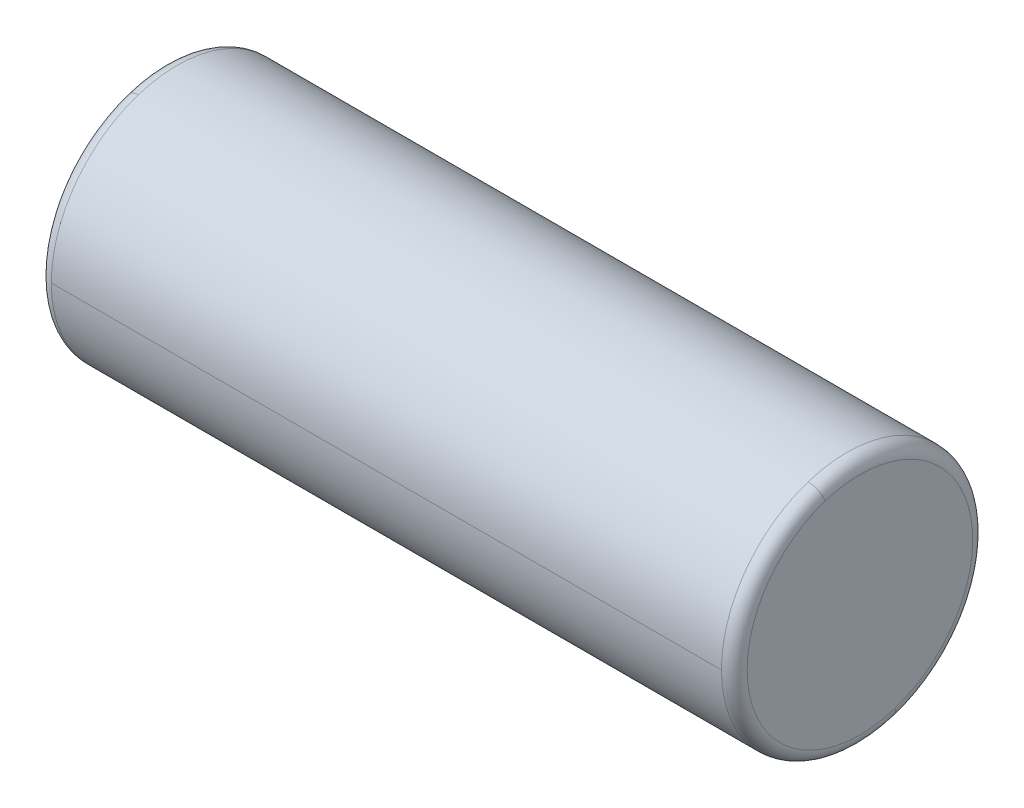
ISO-10303-21;
HEADER;
FILE_DESCRIPTION(('STEP AP214'),'2;1');
FILE_NAME('part.step','',(''),(''),'','','');
FILE_SCHEMA(('AUTOMOTIVE_DESIGN { 1 0 10303 214 1 1 1 1 }'));
ENDSEC;
DATA;
#1=APPLICATION_CONTEXT('core data for automotive mechanical design processes');
#2=APPLICATION_PROTOCOL_DEFINITION('international standard','automotive_design',2000,#1);
#3=PRODUCT_CONTEXT('',#1,'mechanical');
#4=PRODUCT('Part','Part','',(#3));
#5=PRODUCT_RELATED_PRODUCT_CATEGORY('part','',(#4));
#6=PRODUCT_DEFINITION_FORMATION('','',#4);
#7=PRODUCT_DEFINITION_CONTEXT('part definition',#1,'design');
#8=PRODUCT_DEFINITION('design','',#6,#7);
#9=PRODUCT_DEFINITION_SHAPE('','',#8);
#10=(LENGTH_UNIT() NAMED_UNIT(*) SI_UNIT(.MILLI.,.METRE.));
#11=(NAMED_UNIT(*) PLANE_ANGLE_UNIT() SI_UNIT($,.RADIAN.));
#12=(NAMED_UNIT(*) SI_UNIT($,.STERADIAN.) SOLID_ANGLE_UNIT());
#13=UNCERTAINTY_MEASURE_WITH_UNIT(LENGTH_MEASURE(1.E-05),#10,'distance_accuracy_value','');
#14=(GEOMETRIC_REPRESENTATION_CONTEXT(3) GLOBAL_UNCERTAINTY_ASSIGNED_CONTEXT((#13)) GLOBAL_UNIT_ASSIGNED_CONTEXT((#10,
#11,#12)) REPRESENTATION_CONTEXT('',''));
#15=CARTESIAN_POINT('',(0.,0.,0.));
#16=DIRECTION('',(0.,0.,1.));
#17=DIRECTION('',(1.,0.,0.));
#18=AXIS2_PLACEMENT_3D('',#15,#16,#17);
#19=CARTESIAN_POINT('',(4.,50.75,0.));
#20=DIRECTION('',(1.,0.,0.));
#21=DIRECTION('',(0.,0.,-1.));
#22=AXIS2_PLACEMENT_3D('',#19,#20,#21);
#23=PLANE('',#22);
#24=CARTESIAN_POINT('',(4.,53.5239148391939,0.901299566926841));
#25=CARTESIAN_POINT('',(4.,53.5091683074182,0.946688001011676));
#26=CARTESIAN_POINT('',(4.,53.4933059199763,0.991713781039006));
#27=CARTESIAN_POINT('',(4.,53.4593918073549,1.08093314309655));
#28=CARTESIAN_POINT('',(4.,53.4413400821754,1.12512672512677));
#29=CARTESIAN_POINT('',(4.,53.403089667674,1.21257480130799));
#30=CARTESIAN_POINT('',(4.,53.3828909783521,1.25582929545899));
#31=CARTESIAN_POINT('',(4.,53.3403955946315,1.34129510553932));
#32=CARTESIAN_POINT('',(4.,53.3180989002329,1.38350642146864));
#33=CARTESIAN_POINT('',(4.,53.2714611410246,1.46678415392998));
#34=CARTESIAN_POINT('',(4.,53.247120076215,1.50785057046199));
#35=CARTESIAN_POINT('',(4.,53.1964522373842,1.58873957968484));
#36=CARTESIAN_POINT('',(4.,53.1701254633631,1.62856217237568));
#37=CARTESIAN_POINT('',(4.,53.1155496238686,1.7068675956184));
#38=CARTESIAN_POINT('',(4.,53.0873005583951,1.74535042617028));
#39=CARTESIAN_POINT('',(4.,53.0289481920083,1.82088361721079));
#40=CARTESIAN_POINT('',(4.,52.998844891095,1.85793397769941));
#41=CARTESIAN_POINT('',(4.,52.9368565749047,1.93051297089295));
#42=CARTESIAN_POINT('',(4.,52.9049715596277,1.96604160359786));
#43=CARTESIAN_POINT('',(4.,52.8394966286152,2.03549154967787));
#44=CARTESIAN_POINT('',(4.,52.8059067128797,2.06941286305296));
#45=CARTESIAN_POINT('',(4.,52.7371029019695,2.13556645104698));
#46=CARTESIAN_POINT('',(4.,52.7018890067949,2.16779872566592));
#47=CARTESIAN_POINT('',(4.,52.6299220703725,2.23049658577788));
#48=CARTESIAN_POINT('',(4.,52.5931690291246,2.26096217127091));
#49=CARTESIAN_POINT('',(4.,52.5182123418491,2.32005325886632));
#50=CARTESIAN_POINT('',(4.,52.4800086958214,2.3486787609687));
#51=CARTESIAN_POINT('',(4.,52.4022428349163,2.40402072044118));
#52=CARTESIAN_POINT('',(4.,52.3626806200389,2.43073717781128));
#53=CARTESIAN_POINT('',(4.,52.282292930275,2.48219668553324));
#54=CARTESIAN_POINT('',(4.,52.2414674553886,2.5069397358851));
#55=CARTESIAN_POINT('',(4.,52.1586515977516,2.55439282139507));
#56=CARTESIAN_POINT('',(4.,52.1166612150011,2.57710285655318));
#57=CARTESIAN_POINT('',(4.,52.031616700146,2.62043520121178));
#58=CARTESIAN_POINT('',(4.,51.9885625680414,2.64105751071228));
#59=CARTESIAN_POINT('',(4.,51.9014942756533,2.68016472310576));
#60=CARTESIAN_POINT('',(4.,51.8574801153699,2.69864962599875));
#61=CARTESIAN_POINT('',(4.,51.7685978005916,2.73343749342707));
#62=CARTESIAN_POINT('',(4.,51.7237296460967,2.7497404579624));
#63=CARTESIAN_POINT('',(4.,51.6332474342097,2.78012517340586));
#64=CARTESIAN_POINT('',(4.,51.5876333768175,2.794206924314));
#65=CARTESIAN_POINT('',(4.,51.4957692473953,2.82011528833172));
#66=CARTESIAN_POINT('',(4.,51.4495191753654,2.83194190144131));
#67=CARTESIAN_POINT('',(4.,51.3564944371424,2.85331149851506));
#68=CARTESIAN_POINT('',(4.,51.3097197709493,2.86285448247923));
#69=CARTESIAN_POINT('',(4.,51.2157585286677,2.87963383137791));
#70=CARTESIAN_POINT('',(4.,51.1685719525793,2.88687019631242));
#71=CARTESIAN_POINT('',(4.,51.0739005671019,2.89901887411483));
#72=CARTESIAN_POINT('',(4.,51.0264157577129,2.90393118698273));
#73=CARTESIAN_POINT('',(4.,50.9312623006995,2.91141992645995));
#74=CARTESIAN_POINT('',(4.,50.8835936530751,2.91399635306926));
#75=CARTESIAN_POINT('',(4.,50.7881873575381,2.91680711319195));
#76=CARTESIAN_POINT('',(4.,50.7404497096255,2.91704144670532));
#77=CARTESIAN_POINT('',(4.,50.6450204176875,2.91516745610615));
#78=CARTESIAN_POINT('',(4.,50.597328773662,2.91305913199361));
#79=CARTESIAN_POINT('',(4.,50.5021063828459,2.90650490528008));
#80=CARTESIAN_POINT('',(4.,50.4545756360552,2.90205900267908));
#81=CARTESIAN_POINT('',(4.,50.3597895454409,2.89084032955742));
#82=CARTESIAN_POINT('',(4.,50.3125342016172,2.88406755903675));
#83=CARTESIAN_POINT('',(4.,50.2184127591993,2.86821146627315));
#84=CARTESIAN_POINT('',(4.,50.171546660605,2.85912814403022));
#85=CARTESIAN_POINT('',(4.,50.0783166131823,2.83867283034098));
#86=CARTESIAN_POINT('',(4.,50.0319526643539,2.82730083889467));
#87=CARTESIAN_POINT('',(4.,49.9398386112768,2.80229558292214));
#88=CARTESIAN_POINT('',(4.,49.894088507028,2.78866231839592));
#89=CARTESIAN_POINT('',(4.,49.8033123591184,2.75916735999194));
#90=CARTESIAN_POINT('',(4.,49.7582863154576,2.74330566611418));
#91=CARTESIAN_POINT('',(4.,49.6690667604069,2.709392061217));
#92=CARTESIAN_POINT('',(4.,49.6248732490171,2.69134015019757));
#93=CARTESIAN_POINT('',(4.,49.5374252245482,2.65308959965187));
#94=CARTESIAN_POINT('',(4.,49.4941707114692,2.63289096012558));
#95=CARTESIAN_POINT('',(4.,49.4087048875326,2.59039561285797));
#96=CARTESIAN_POINT('',(4.,49.366493576675,2.56809890511664));
#97=CARTESIAN_POINT('',(4.,49.2832158479264,2.52146113614085));
#98=CARTESIAN_POINT('',(4.,49.2421494300354,2.49712007490638));
#99=CARTESIAN_POINT('',(4.,49.1612604198178,2.44645223869284));
#100=CARTESIAN_POINT('',(4.,49.121437827491,2.42012546371378));
#101=CARTESIAN_POINT('',(4.,49.0431324045149,2.36554962351792));
#102=CARTESIAN_POINT('',(4.,49.0046495738654,2.33730055830113));
#103=CARTESIAN_POINT('',(4.,48.9291163827535,2.27894819210227));
#104=CARTESIAN_POINT('',(4.,48.892066022291,2.2488448911202));
#105=CARTESIAN_POINT('',(4.,48.8194870291166,2.18685657487956));
#106=CARTESIAN_POINT('',(4.,48.7839583964047,2.154971559621));
#107=CARTESIAN_POINT('',(4.,48.7145084503196,2.08949662862195));
#108=CARTESIAN_POINT('',(4.,48.6805871369464,2.05590671288146));
#109=CARTESIAN_POINT('',(4.,48.6144335489537,1.9871029019677));
#110=CARTESIAN_POINT('',(4.,48.5822012743343,1.95188900679443));
#111=CARTESIAN_POINT('',(4.,48.5195034142219,1.87992207037295));
#112=CARTESIAN_POINT('',(4.,48.4890378287291,1.84316902912474));
#113=CARTESIAN_POINT('',(4.,48.4299467411337,1.76821234184894));
#114=CARTESIAN_POINT('',(4.,48.4013212390313,1.73000869582136));
#115=CARTESIAN_POINT('',(4.,48.3459792795588,1.65224283491632));
#116=CARTESIAN_POINT('',(4.,48.3192628221887,1.61268062003887));
#117=CARTESIAN_POINT('',(4.,48.2678033144668,1.532292930275));
#118=CARTESIAN_POINT('',(4.,48.2430602641149,1.49146745538858));
#119=CARTESIAN_POINT('',(4.,48.1956071786049,1.40865159775164));
#120=CARTESIAN_POINT('',(4.,48.1728971434468,1.36666121500113));
#121=CARTESIAN_POINT('',(4.,48.1295647987882,1.28161670014598));
#122=CARTESIAN_POINT('',(4.,48.1089424892877,1.23856256804136));
#123=CARTESIAN_POINT('',(4.,48.0698352768942,1.15149427565331));
#124=CARTESIAN_POINT('',(4.,48.0513503740012,1.1074801153699));
#125=CARTESIAN_POINT('',(4.,48.0165625065729,1.01859780059161));
#126=CARTESIAN_POINT('',(4.,48.0002595420376,0.973729646096735));
#127=CARTESIAN_POINT('',(4.,47.9698748265941,0.883247434209639));
#128=CARTESIAN_POINT('',(4.,47.9557930756859,0.837633376817419));
#129=CARTESIAN_POINT('',(4.,47.9298847116684,0.745769247395375));
#130=CARTESIAN_POINT('',(4.,47.9180580985592,0.699519175365551));
#131=CARTESIAN_POINT('',(4.,47.8966885014844,0.606494437142247));
#132=CARTESIAN_POINT('',(4.,47.8871455175189,0.559719770948768));
#133=CARTESIAN_POINT('',(4.,47.870366168624,0.465758528668218));
#134=CARTESIAN_POINT('',(4.,47.8631298036945,0.418571952581148));
#135=CARTESIAN_POINT('',(4.,47.8509811258782,0.323900567099962));
#136=CARTESIAN_POINT('',(4.,47.8460688129913,0.276415757705846));
#137=CARTESIAN_POINT('',(4.,47.8385800735661,0.181262300706558));
#138=CARTESIAN_POINT('',(4.,47.8360036470277,0.133593653101386));
#139=CARTESIAN_POINT('',(4.,47.833192886711,0.0381873575117354));
#140=CARTESIAN_POINT('',(4.,47.8329585529327,-0.00955029047274379));
#141=CARTESIAN_POINT('',(4.,47.8348325442559,-0.104979582214222));
#142=CARTESIAN_POINT('',(4.,47.8369408693575,-0.152671225971221));
#143=CARTESIAN_POINT('',(4.,47.8434950933689,-0.247893617520897));
#144=CARTESIAN_POINT('',(4.,47.8479409922787,-0.295424365313575));
#145=CARTESIAN_POINT('',(4.,47.8591596754848,-0.390210453190387));
#146=CARTESIAN_POINT('',(4.,47.865932459781,-0.437465793274523));
#147=CARTESIAN_POINT('',(4.,47.8817885149091,-0.53158724590899));
#148=CARTESIAN_POINT('',(4.,47.8908717857408,-0.578453358459322));
#149=CARTESIAN_POINT('',(4.,47.911327239888,-0.671683367753326));
#150=CARTESIAN_POINT('',(4.,47.9226994232033,-0.718047264496998));
#151=CARTESIAN_POINT('',(4.,47.9477041549798,-0.810161459872296));
#152=CARTESIAN_POINT('',(4.,47.961336703441,-0.855911758503923));
#153=CARTESIAN_POINT('',(4.,47.9760851608061,-0.901299566926831));
#154=B_SPLINE_CURVE_WITH_KNOTS('',3,(#24,#25,#26,#27,#28,#29,#30,#31,#32,#33,#34,#35,#36,#37,
#38,#39,#40,#41,#42,#43,#44,#45,#46,#47,#48,#49,#50,#51,#52,#53,#54,#55,#56,#57,#58,#59,#60,#61,
#62,#63,#64,#65,#66,#67,#68,#69,#70,#71,#72,#73,#74,#75,#76,#77,#78,#79,#80,#81,#82,#83,#84,#85,
#86,#87,#88,#89,#90,#91,#92,#93,#94,#95,#96,#97,#98,#99,#100,#101,#102,#103,#104,#105,#106,#107,
#108,#109,#110,#111,#112,#113,#114,#115,#116,#117,#118,#119,#120,#121,#122,#123,#124,#125,#126,
#127,#128,#129,#130,#131,#132,#133,#134,#135,#136,#137,#138,#139,#140,#141,#142,#143,#144,#145,
#146,#147,#148,#149,#150,#151,#152,#153),.UNSPECIFIED.,.F.,.F.,(4,2,2,2,2,2,2,2,2,2,2,2,2,2,2,2,
2,2,2,2,2,2,2,2,2,2,2,2,2,2,2,2,2,2,2,2,2,2,2,2,2,2,2,2,2,2,2,2,2,2,2,2,2,2,2,2,2,2,2,2,2,2,2,2,
4),(0.,0.14315716638364,0.286314332767282,0.429471499150922,0.572628665534562,0.715785831918205,
0.858942998301844,1.00210016468549,1.14525733106912,1.28841449745277,1.43157166383641,
1.57472883022005,1.71788599660369,1.86104316298733,2.00420032937097,2.14735749575461,
2.29051466213825,2.43367182852189,2.57682899490553,2.71998616128918,2.86314332767281,
3.00630049405645,3.14945766044009,3.29261482682374,3.43577199320738,3.57892915959102,
3.72208632597466,3.8652434923583,4.00840065874194,4.15155782512558,4.29471499150922,
4.43787215789286,4.5810293242765,4.72418649066014,4.86734365704378,5.01050082342742,
5.15365798981106,5.29681515619471,5.43997232257835,5.58312948896199,5.72628665534563,
5.86944382172927,6.01260098811291,6.15575815449655,6.29891532088019,6.44207248726384,
6.58522965364747,6.72838682003111,6.87154398641476,7.0147011527984,7.15785831918204,
7.30101548556568,7.44417265194932,7.58732981833296,7.7304869847166,7.87364415110024,
8.01680131748388,8.15995848386752,8.30311565025116,8.4462728166348,8.58942998301844,
8.73258714940209,8.87574431578573,9.01890148216937,9.16205864855301),.UNSPECIFIED.);
#155=CARTESIAN_POINT('',(4.,53.5239148391939,0.901299566926841));
#156=VERTEX_POINT('',#155);
#157=CARTESIAN_POINT('',(4.,47.9760851608061,-0.901299566926841));
#158=VERTEX_POINT('',#157);
#159=EDGE_CURVE('E11',#156,#158,#154,.T.);
#160=ORIENTED_EDGE('',*,*,#159,.F.);
#161=CARTESIAN_POINT('',(4.,47.9760851608061,-0.901299566926841));
#162=CARTESIAN_POINT('',(4.,47.9908316925818,-0.946688001011676));
#163=CARTESIAN_POINT('',(4.,48.0066940800237,-0.991713781039005));
#164=CARTESIAN_POINT('',(4.,48.0406081926451,-1.08093314309655));
#165=CARTESIAN_POINT('',(4.,48.0586599178246,-1.12512672512677));
#166=CARTESIAN_POINT('',(4.,48.096910332326,-1.21257480130799));
#167=CARTESIAN_POINT('',(4.,48.1171090216479,-1.25582929545899));
#168=CARTESIAN_POINT('',(4.,48.1596044053685,-1.34129510553932));
#169=CARTESIAN_POINT('',(4.,48.1819010997671,-1.38350642146864));
#170=CARTESIAN_POINT('',(4.,48.2285388589754,-1.46678415392998));
#171=CARTESIAN_POINT('',(4.,48.252879923785,-1.50785057046199));
#172=CARTESIAN_POINT('',(4.,48.3035477626158,-1.58873957968484));
#173=CARTESIAN_POINT('',(4.,48.3298745366369,-1.62856217237568));
#174=CARTESIAN_POINT('',(4.,48.3844503761314,-1.7068675956184));
#175=CARTESIAN_POINT('',(4.,48.4126994416049,-1.74535042617028));
#176=CARTESIAN_POINT('',(4.,48.4710518079917,-1.82088361721079));
#177=CARTESIAN_POINT('',(4.,48.501155108905,-1.85793397769941));
#178=CARTESIAN_POINT('',(4.,48.5631434250953,-1.93051297089295));
#179=CARTESIAN_POINT('',(4.,48.5950284403723,-1.96604160359786));
#180=CARTESIAN_POINT('',(4.,48.6605033713848,-2.03549154967787));
#181=CARTESIAN_POINT('',(4.,48.6940932871204,-2.06941286305296));
#182=CARTESIAN_POINT('',(4.,48.7628970980305,-2.13556645104698));
#183=CARTESIAN_POINT('',(4.,48.7981109932051,-2.16779872566592));
#184=CARTESIAN_POINT('',(4.,48.8700779296275,-2.23049658577788));
#185=CARTESIAN_POINT('',(4.,48.9068309708754,-2.26096217127091));
#186=CARTESIAN_POINT('',(4.,48.9817876581509,-2.32005325886632));
#187=CARTESIAN_POINT('',(4.,49.0199913041786,-2.3486787609687));
#188=CARTESIAN_POINT('',(4.,49.0977571650837,-2.40402072044118));
#189=CARTESIAN_POINT('',(4.,49.1373193799611,-2.43073717781128));
#190=CARTESIAN_POINT('',(4.,49.217707069725,-2.48219668553324));
#191=CARTESIAN_POINT('',(4.,49.2585325446114,-2.5069397358851));
#192=CARTESIAN_POINT('',(4.,49.3413484022484,-2.55439282139507));
#193=CARTESIAN_POINT('',(4.,49.3833387849989,-2.57710285655318));
#194=CARTESIAN_POINT('',(4.,49.468383299854,-2.62043520121178));
#195=CARTESIAN_POINT('',(4.,49.5114374319587,-2.64105751071228));
#196=CARTESIAN_POINT('',(4.,49.5985057243467,-2.68016472310576));
#197=CARTESIAN_POINT('',(4.,49.6425198846301,-2.69864962599875));
#198=CARTESIAN_POINT('',(4.,49.7314021994084,-2.73343749342707));
#199=CARTESIAN_POINT('',(4.,49.7762703539033,-2.7497404579624));
#200=CARTESIAN_POINT('',(4.,49.8667525657904,-2.78012517340586));
#201=CARTESIAN_POINT('',(4.,49.9123666231825,-2.794206924314));
#202=CARTESIAN_POINT('',(4.,50.0042307526047,-2.82011528833172));
#203=CARTESIAN_POINT('',(4.,50.0504808246346,-2.83194190144131));
#204=CARTESIAN_POINT('',(4.,50.1435055628576,-2.85331149851506));
#205=CARTESIAN_POINT('',(4.,50.1902802290507,-2.86285448247923));
#206=CARTESIAN_POINT('',(4.,50.2842414713323,-2.87963383137791));
#207=CARTESIAN_POINT('',(4.,50.3314280474208,-2.88687019631242));
#208=CARTESIAN_POINT('',(4.,50.4260994328982,-2.89901887411483));
#209=CARTESIAN_POINT('',(4.,50.4735842422871,-2.90393118698273));
#210=CARTESIAN_POINT('',(4.,50.5687376993005,-2.91141992645995));
#211=CARTESIAN_POINT('',(4.,50.6164063469249,-2.91399635306926));
#212=CARTESIAN_POINT('',(4.,50.7118126424619,-2.91680711319195));
#213=CARTESIAN_POINT('',(4.,50.7595502903745,-2.91704144670532));
#214=CARTESIAN_POINT('',(4.,50.8549795823125,-2.91516745610615));
#215=CARTESIAN_POINT('',(4.,50.902671226338,-2.91305913199361));
#216=CARTESIAN_POINT('',(4.,50.9978936171541,-2.90650490528008));
#217=CARTESIAN_POINT('',(4.,51.0454243639448,-2.90205900267908));
#218=CARTESIAN_POINT('',(4.,51.1402104545591,-2.89084032955742));
#219=CARTESIAN_POINT('',(4.,51.1874657983828,-2.88406755903675));
#220=CARTESIAN_POINT('',(4.,51.2815872408007,-2.86821146627315));
#221=CARTESIAN_POINT('',(4.,51.328453339395,-2.85912814403022));
#222=CARTESIAN_POINT('',(4.,51.4216833868177,-2.83867283034098));
#223=CARTESIAN_POINT('',(4.,51.4680473356461,-2.82730083889467));
#224=CARTESIAN_POINT('',(4.,51.5601613887233,-2.80229558292214));
#225=CARTESIAN_POINT('',(4.,51.605911492972,-2.78866231839592));
#226=CARTESIAN_POINT('',(4.,51.6966876408816,-2.75916735999194));
#227=CARTESIAN_POINT('',(4.,51.7417136845425,-2.74330566611418));
#228=CARTESIAN_POINT('',(4.,51.8309332395931,-2.709392061217));
#229=CARTESIAN_POINT('',(4.,51.8751267509829,-2.69134015019757));
#230=CARTESIAN_POINT('',(4.,51.9625747754518,-2.65308959965187));
#231=CARTESIAN_POINT('',(4.,52.0058292885308,-2.63289096012558));
#232=CARTESIAN_POINT('',(4.,52.0912951124675,-2.59039561285797));
#233=CARTESIAN_POINT('',(4.,52.133506423325,-2.56809890511664));
#234=CARTESIAN_POINT('',(4.,52.2167841520736,-2.52146113614085));
#235=CARTESIAN_POINT('',(4.,52.2578505699646,-2.49712007490638));
#236=CARTESIAN_POINT('',(4.,52.3387395801823,-2.44645223869284));
#237=CARTESIAN_POINT('',(4.,52.378562172509,-2.42012546371378));
#238=CARTESIAN_POINT('',(4.,52.4568675954851,-2.36554962351792));
#239=CARTESIAN_POINT('',(4.,52.4953504261346,-2.33730055830114));
#240=CARTESIAN_POINT('',(4.,52.5708836172465,-2.27894819210227));
#241=CARTESIAN_POINT('',(4.,52.607933977709,-2.2488448911202));
#242=CARTESIAN_POINT('',(4.,52.6805129708834,-2.18685657487956));
#243=CARTESIAN_POINT('',(4.,52.7160416035953,-2.154971559621));
#244=CARTESIAN_POINT('',(4.,52.7854915496804,-2.08949662862195));
#245=CARTESIAN_POINT('',(4.,52.8194128630536,-2.05590671288146));
#246=CARTESIAN_POINT('',(4.,52.8855664510463,-1.9871029019677));
#247=CARTESIAN_POINT('',(4.,52.9177987256657,-1.95188900679443));
#248=CARTESIAN_POINT('',(4.,52.9804965857781,-1.87992207037295));
#249=CARTESIAN_POINT('',(4.,53.010962171271,-1.84316902912475));
#250=CARTESIAN_POINT('',(4.,53.0700532588663,-1.76821234184895));
#251=CARTESIAN_POINT('',(4.,53.0986787609687,-1.73000869582136));
#252=CARTESIAN_POINT('',(4.,53.1540207204412,-1.65224283491632));
#253=CARTESIAN_POINT('',(4.,53.1807371778113,-1.61268062003888));
#254=CARTESIAN_POINT('',(4.,53.2321966855332,-1.532292930275));
#255=CARTESIAN_POINT('',(4.,53.2569397358851,-1.49146745538858));
#256=CARTESIAN_POINT('',(4.,53.3043928213951,-1.40865159775164));
#257=CARTESIAN_POINT('',(4.,53.3271028565532,-1.36666121500113));
#258=CARTESIAN_POINT('',(4.,53.3704352012118,-1.28161670014599));
#259=CARTESIAN_POINT('',(4.,53.3910575107123,-1.23856256804136));
#260=CARTESIAN_POINT('',(4.,53.4301647231058,-1.15149427565332));
#261=CARTESIAN_POINT('',(4.,53.4486496259988,-1.1074801153699));
#262=CARTESIAN_POINT('',(4.,53.4834374934271,-1.01859780059162));
#263=CARTESIAN_POINT('',(4.,53.4997404579624,-0.973729646096739));
#264=CARTESIAN_POINT('',(4.,53.5301251734059,-0.883247434209643));
#265=CARTESIAN_POINT('',(4.,53.5442069243141,-0.837633376817423));
#266=CARTESIAN_POINT('',(4.,53.5701152883316,-0.745769247395379));
#267=CARTESIAN_POINT('',(4.,53.5819419014408,-0.699519175365554));
#268=CARTESIAN_POINT('',(4.,53.6033114985156,-0.606494437142251));
#269=CARTESIAN_POINT('',(4.,53.6128544824811,-0.559719770948772));
#270=CARTESIAN_POINT('',(4.,53.629633831376,-0.465758528668222));
#271=CARTESIAN_POINT('',(4.,53.6368701963055,-0.418571952581151));
#272=CARTESIAN_POINT('',(4.,53.6490188741218,-0.323900567099965));
#273=CARTESIAN_POINT('',(4.,53.6539311870087,-0.27641575770585));
#274=CARTESIAN_POINT('',(4.,53.661419926434,-0.181262300706564));
#275=CARTESIAN_POINT('',(4.,53.6639963529723,-0.133593653101392));
#276=CARTESIAN_POINT('',(4.,53.666807113289,-0.0381873575117411));
#277=CARTESIAN_POINT('',(4.,53.6670414470673,0.00955029047273823));
#278=CARTESIAN_POINT('',(4.,53.6651674557441,0.104979582214216));
#279=CARTESIAN_POINT('',(4.,53.6630591306426,0.152671225971215));
#280=CARTESIAN_POINT('',(4.,53.6565049066311,0.247893617520892));
#281=CARTESIAN_POINT('',(4.,53.6520590077213,0.295424365313569));
#282=CARTESIAN_POINT('',(4.,53.6408403245152,0.390210453190383));
#283=CARTESIAN_POINT('',(4.,53.634067540219,0.437465793274519));
#284=CARTESIAN_POINT('',(4.,53.6182114850909,0.531587245908987));
#285=CARTESIAN_POINT('',(4.,53.6091282142592,0.578453358459319));
#286=CARTESIAN_POINT('',(4.,53.588672760112,0.671683367753323));
#287=CARTESIAN_POINT('',(4.,53.5773005767967,0.718047264496995));
#288=CARTESIAN_POINT('',(4.,53.5522958450202,0.810161459872292));
#289=CARTESIAN_POINT('',(4.,53.538663296559,0.855911758503917));
#290=CARTESIAN_POINT('',(4.,53.5239148391939,0.901299566926825));
#291=B_SPLINE_CURVE_WITH_KNOTS('',3,(#161,#162,#163,#164,#165,#166,#167,#168,#169,#170,#171,
#172,#173,#174,#175,#176,#177,#178,#179,#180,#181,#182,#183,#184,#185,#186,#187,#188,#189,#190,
#191,#192,#193,#194,#195,#196,#197,#198,#199,#200,#201,#202,#203,#204,#205,#206,#207,#208,#209,
#210,#211,#212,#213,#214,#215,#216,#217,#218,#219,#220,#221,#222,#223,#224,#225,#226,#227,#228,
#229,#230,#231,#232,#233,#234,#235,#236,#237,#238,#239,#240,#241,#242,#243,#244,#245,#246,#247,
#248,#249,#250,#251,#252,#253,#254,#255,#256,#257,#258,#259,#260,#261,#262,#263,#264,#265,#266,
#267,#268,#269,#270,#271,#272,#273,#274,#275,#276,#277,#278,#279,#280,#281,#282,#283,#284,#285,
#286,#287,#288,#289,#290),.UNSPECIFIED.,.F.,.F.,(4,2,2,2,2,2,2,2,2,2,2,2,2,2,2,2,2,2,2,2,2,2,2,
2,2,2,2,2,2,2,2,2,2,2,2,2,2,2,2,2,2,2,2,2,2,2,2,2,2,2,2,2,2,2,2,2,2,2,2,2,2,2,2,2,4),(0.,
0.14315716638364,0.286314332767282,0.429471499150921,0.572628665534561,0.715785831918205,
0.858942998301843,1.00210016468549,1.14525733106912,1.28841449745277,1.43157166383641,
1.57472883022005,1.71788599660369,1.86104316298733,2.00420032937097,2.14735749575461,
2.29051466213825,2.43367182852189,2.57682899490553,2.71998616128917,2.86314332767281,
3.00630049405645,3.14945766044009,3.29261482682374,3.43577199320737,3.57892915959102,
3.72208632597466,3.8652434923583,4.00840065874193,4.15155782512558,4.29471499150922,
4.43787215789286,4.5810293242765,4.72418649066014,4.86734365704378,5.01050082342742,
5.15365798981106,5.29681515619471,5.43997232257834,5.58312948896199,5.72628665534563,
5.86944382172927,6.01260098811291,6.15575815449655,6.29891532088019,6.44207248726383,
6.58522965364747,6.72838682003111,6.87154398641475,7.01470115279839,7.15785831918203,
7.30101548556568,7.44417265194932,7.58732981833296,7.7304869847166,7.87364415110024,
8.01680131748388,8.15995848386752,8.30311565025116,8.4462728166348,8.58942998301844,
8.73258714940208,8.87574431578572,9.01890148216936,9.162058648553),.UNSPECIFIED.);
#292=EDGE_CURVE('E26',#158,#156,#291,.T.);
#293=ORIENTED_EDGE('',*,*,#292,.F.);
#294=EDGE_LOOP('',(#160,#293));
#295=FACE_BOUND('',#294,.T.);
#296=ADVANCED_FACE('F17',(#295),#23,.F.);
#297=CARTESIAN_POINT('',(4.33333333333361,50.75,0.));
#298=DIRECTION('',(1.,0.,0.));
#299=DIRECTION('',(0.,-0.309016994374947,0.951056516295154));
#300=AXIS2_PLACEMENT_3D('',#297,#298,#299);
#301=TOROIDAL_SURFACE('',#300,2.91666666666638,0.333333333333611);
#302=CARTESIAN_POINT('',(4.33333333333361,47.9760851608061,-0.901299566926841));
#303=DIRECTION('',(0.,0.309016994374949,-0.951056516295153));
#304=DIRECTION('',(-9.32587340684358E-13,-0.951056516295153,-0.309016994374949));
#305=AXIS2_PLACEMENT_3D('',#302,#303,#304);
#306=CIRCLE('',#305,0.33333333333361);
#307=CARTESIAN_POINT('',(4.3333333333333,47.6590663220408,-1.00430523171858));
#308=VERTEX_POINT('',#307);
#309=EDGE_CURVE('E139',#308,#158,#306,.T.);
#310=ORIENTED_EDGE('',*,*,#309,.T.);
#311=ORIENTED_EDGE('',*,*,#292,.T.);
#312=CARTESIAN_POINT('',(4.33333333333361,53.5239148391939,0.901299566926841));
#313=DIRECTION('',(0.,-0.309016994374949,0.951056516295153));
#314=DIRECTION('',(-9.32587340684358E-13,0.951056516295153,0.309016994374949));
#315=AXIS2_PLACEMENT_3D('',#312,#313,#314);
#316=CIRCLE('',#315,0.33333333333361);
#317=CARTESIAN_POINT('',(4.3333333333333,53.8409336779592,1.00430523171858));
#318=VERTEX_POINT('',#317);
#319=EDGE_CURVE('E135',#318,#156,#316,.T.);
#320=ORIENTED_EDGE('',*,*,#319,.F.);
#321=CARTESIAN_POINT('',(4.3333333333333,50.75,0.));
#322=DIRECTION('',(1.,0.,0.));
#323=DIRECTION('',(0.,0.,-1.));
#324=AXIS2_PLACEMENT_3D('',#321,#322,#323);
#325=CIRCLE('',#324,3.25);
#326=CARTESIAN_POINT('',(4.3333333333333,50.75,-3.25));
#327=VERTEX_POINT('',#326);
#328=EDGE_CURVE('E130',#327,#318,#325,.T.);
#329=ORIENTED_EDGE('',*,*,#328,.F.);
#330=CARTESIAN_POINT('',(4.3333333333333,50.75,0.));
#331=DIRECTION('',(1.,0.,0.));
#332=DIRECTION('',(0.,0.,-1.));
#333=AXIS2_PLACEMENT_3D('',#330,#331,#332);
#334=CIRCLE('',#333,3.25);
#335=EDGE_CURVE('E125',#308,#327,#334,.T.);
#336=ORIENTED_EDGE('',*,*,#335,.F.);
#337=EDGE_LOOP('',(#310,#311,#320,#329,#336));
#338=FACE_BOUND('',#337,.T.);
#339=ADVANCED_FACE('F146',(#338),#301,.T.);
#340=CARTESIAN_POINT('',(22.,50.75,0.));
#341=DIRECTION('',(1.,0.,0.));
#342=DIRECTION('',(0.,1.,0.));
#343=AXIS2_PLACEMENT_3D('',#340,#341,#342);
#344=CYLINDRICAL_SURFACE('',#343,3.25);
#345=DIRECTION('',(1.,0.,0.));
#346=VECTOR('',#345,1.);
#347=CARTESIAN_POINT('',(4.3333333333333,50.75,3.25));
#348=LINE('',#347,#346);
#349=CARTESIAN_POINT('',(4.3333333333333,50.75,3.25));
#350=VERTEX_POINT('',#349);
#351=CARTESIAN_POINT('',(21.666666666667,50.75,3.25));
#352=VERTEX_POINT('',#351);
#353=EDGE_CURVE('E92',#350,#352,#348,.T.);
#354=ORIENTED_EDGE('',*,*,#353,.F.);
#355=CARTESIAN_POINT('',(4.3333333333333,50.75,0.));
#356=DIRECTION('',(1.,0.,0.));
#357=DIRECTION('',(0.,0.,-1.));
#358=AXIS2_PLACEMENT_3D('',#355,#356,#357);
#359=CIRCLE('',#358,3.25);
#360=EDGE_CURVE('E117',#350,#308,#359,.T.);
#361=ORIENTED_EDGE('',*,*,#360,.T.);
#362=ORIENTED_EDGE('',*,*,#335,.T.);
#363=DIRECTION('',(1.,0.,0.));
#364=VECTOR('',#363,1.);
#365=CARTESIAN_POINT('',(4.3333333333333,50.75,-3.25));
#366=LINE('',#365,#364);
#367=CARTESIAN_POINT('',(21.666666666667,50.75,-3.25));
#368=VERTEX_POINT('',#367);
#369=EDGE_CURVE('E113',#327,#368,#366,.T.);
#370=ORIENTED_EDGE('',*,*,#369,.T.);
#371=CARTESIAN_POINT('',(21.666666666667,50.75,0.));
#372=DIRECTION('',(1.,0.,0.));
#373=DIRECTION('',(0.,0.,-1.));
#374=AXIS2_PLACEMENT_3D('',#371,#372,#373);
#375=CIRCLE('',#374,3.25);
#376=CARTESIAN_POINT('',(21.666666666667,47.6590663220408,-1.00430523171858));
#377=VERTEX_POINT('',#376);
#378=EDGE_CURVE('E84',#377,#368,#375,.T.);
#379=ORIENTED_EDGE('',*,*,#378,.F.);
#380=CARTESIAN_POINT('',(21.666666666667,50.75,0.));
#381=DIRECTION('',(1.,0.,0.));
#382=DIRECTION('',(0.,0.,-1.));
#383=AXIS2_PLACEMENT_3D('',#380,#381,#382);
#384=CIRCLE('',#383,3.25);
#385=EDGE_CURVE('E106',#352,#377,#384,.T.);
#386=ORIENTED_EDGE('',*,*,#385,.F.);
#387=EDGE_LOOP('',(#354,#361,#362,#370,#379,#386));
#388=FACE_BOUND('',#387,.T.);
#389=ADVANCED_FACE('F155',(#388),#344,.T.);
#390=CARTESIAN_POINT('',(21.666666666666,50.75,0.));
#391=DIRECTION('',(1.,0.,0.));
#392=DIRECTION('',(0.,0.309016994374947,-0.951056516295154));
#393=AXIS2_PLACEMENT_3D('',#390,#391,#392);
#394=TOROIDAL_SURFACE('',#393,2.91666666666604,0.333333333333949);
#395=CARTESIAN_POINT('',(21.666666666666,47.9760851608064,-0.901299566926737));
#396=DIRECTION('',(0.,0.309016994374947,-0.951056516295154));
#397=DIRECTION('',(1.,0.,0.));
#398=AXIS2_PLACEMENT_3D('',#395,#396,#397);
#399=CIRCLE('',#398,0.33333333333395);
#400=CARTESIAN_POINT('',(22.,47.9760851608064,-0.901299566926737));
#401=VERTEX_POINT('',#400);
#402=EDGE_CURVE('E102',#401,#377,#399,.T.);
#403=ORIENTED_EDGE('',*,*,#402,.F.);
#404=CARTESIAN_POINT('',(22.,50.75,0.));
#405=DIRECTION('',(1.,0.,0.));
#406=DIRECTION('',(0.,0.,-1.));
#407=AXIS2_PLACEMENT_3D('',#404,#405,#406);
#408=CIRCLE('',#407,2.916666666667);
#409=CARTESIAN_POINT('',(22.,53.5239148391936,0.901299566926738));
#410=VERTEX_POINT('',#409);
#411=EDGE_CURVE('E74',#410,#401,#408,.T.);
#412=ORIENTED_EDGE('',*,*,#411,.F.);
#413=CARTESIAN_POINT('',(21.666666666666,53.5239148391936,0.901299566926738));
#414=DIRECTION('',(0.,-0.309016994374947,0.951056516295154));
#415=DIRECTION('',(1.,0.,0.));
#416=AXIS2_PLACEMENT_3D('',#413,#414,#415);
#417=CIRCLE('',#416,0.33333333333395);
#418=CARTESIAN_POINT('',(21.666666666667,53.8409336779592,1.00430523171858));
#419=VERTEX_POINT('',#418);
#420=EDGE_CURVE('E67',#410,#419,#417,.T.);
#421=ORIENTED_EDGE('',*,*,#420,.T.);
#422=CARTESIAN_POINT('',(21.666666666667,50.75,0.));
#423=DIRECTION('',(1.,0.,0.));
#424=DIRECTION('',(0.,0.,-1.));
#425=AXIS2_PLACEMENT_3D('',#422,#423,#424);
#426=CIRCLE('',#425,3.25);
#427=EDGE_CURVE('E72',#419,#352,#426,.T.);
#428=ORIENTED_EDGE('',*,*,#427,.T.);
#429=ORIENTED_EDGE('',*,*,#385,.T.);
#430=EDGE_LOOP('',(#403,#412,#421,#428,#429));
#431=FACE_BOUND('',#430,.T.);
#432=ADVANCED_FACE('F69',(#431),#394,.T.);
#433=CARTESIAN_POINT('',(22.,50.75,0.));
#434=DIRECTION('',(1.,0.,0.));
#435=DIRECTION('',(0.,-1.,0.));
#436=AXIS2_PLACEMENT_3D('',#433,#434,#435);
#437=CYLINDRICAL_SURFACE('',#436,3.25);
#438=ORIENTED_EDGE('',*,*,#353,.T.);
#439=ORIENTED_EDGE('',*,*,#427,.F.);
#440=CARTESIAN_POINT('',(21.666666666667,50.75,0.));
#441=DIRECTION('',(1.,0.,0.));
#442=DIRECTION('',(0.,0.,-1.));
#443=AXIS2_PLACEMENT_3D('',#440,#441,#442);
#444=CIRCLE('',#443,3.25);
#445=EDGE_CURVE('E81',#368,#419,#444,.T.);
#446=ORIENTED_EDGE('',*,*,#445,.F.);
#447=ORIENTED_EDGE('',*,*,#369,.F.);
#448=ORIENTED_EDGE('',*,*,#328,.T.);
#449=CARTESIAN_POINT('',(4.3333333333333,50.75,0.));
#450=DIRECTION('',(1.,0.,0.));
#451=DIRECTION('',(0.,0.,-1.));
#452=AXIS2_PLACEMENT_3D('',#449,#450,#451);
#453=CIRCLE('',#452,3.25);
#454=EDGE_CURVE('E87',#318,#350,#453,.T.);
#455=ORIENTED_EDGE('',*,*,#454,.T.);
#456=EDGE_LOOP('',(#438,#439,#446,#447,#448,#455));
#457=FACE_BOUND('',#456,.T.);
#458=ADVANCED_FACE('F90',(#457),#437,.T.);
#459=CARTESIAN_POINT('',(4.33333333333361,50.75,0.));
#460=DIRECTION('',(1.,0.,0.));
#461=DIRECTION('',(0.,0.309016994374947,-0.951056516295154));
#462=AXIS2_PLACEMENT_3D('',#459,#460,#461);
#463=TOROIDAL_SURFACE('',#462,2.91666666666638,0.333333333333611);
#464=ORIENTED_EDGE('',*,*,#309,.F.);
#465=ORIENTED_EDGE('',*,*,#360,.F.);
#466=ORIENTED_EDGE('',*,*,#454,.F.);
#467=ORIENTED_EDGE('',*,*,#319,.T.);
#468=ORIENTED_EDGE('',*,*,#159,.T.);
#469=EDGE_LOOP('',(#464,#465,#466,#467,#468));
#470=FACE_BOUND('',#469,.T.);
#471=ADVANCED_FACE('F164',(#470),#463,.T.);
#472=CARTESIAN_POINT('',(21.666666666666,50.75,0.));
#473=DIRECTION('',(1.,0.,0.));
#474=DIRECTION('',(0.,-0.309016994374947,0.951056516295154));
#475=AXIS2_PLACEMENT_3D('',#472,#473,#474);
#476=TOROIDAL_SURFACE('',#475,2.91666666666604,0.333333333333949);
#477=ORIENTED_EDGE('',*,*,#402,.T.);
#478=ORIENTED_EDGE('',*,*,#378,.T.);
#479=ORIENTED_EDGE('',*,*,#445,.T.);
#480=ORIENTED_EDGE('',*,*,#420,.F.);
#481=CARTESIAN_POINT('',(22.,47.9760851608055,-0.90129956692703));
#482=CARTESIAN_POINT('',(22.,48.2595021725735,-1.77236309517524));
#483=CARTESIAN_POINT('',(22.,48.8834571940752,-2.53461988654938));
#484=CARTESIAN_POINT('',(22.,49.7971069218598,-2.99896222133912));
#485=CARTESIAN_POINT('',(22.,51.7622194429626,-3.11529111561476));
#486=CARTESIAN_POINT('',(22.,53.2836524599231,-1.86611490420942));
#487=CARTESIAN_POINT('',(22.,53.7498770402024,-0.953424228403923));
#488=CARTESIAN_POINT('',(22.,53.8066239558933,0.0300060296279545));
#489=CARTESIAN_POINT('',(22.,53.5239148391945,0.90129956692703));
#490=B_SPLINE_CURVE_WITH_KNOTS('',5,(#481,#482,#483,#484,#485,#486,#487,#488,#489),
.UNSPECIFIED.,.F.,.F.,(6,3,6),(0.,1.5707963267949,3.14159265358979),.UNSPECIFIED.);
#491=EDGE_CURVE('E185',#401,#410,#490,.T.);
#492=ORIENTED_EDGE('',*,*,#491,.F.);
#493=EDGE_LOOP('',(#477,#478,#479,#480,#492));
#494=FACE_BOUND('',#493,.T.);
#495=ADVANCED_FACE('F83',(#494),#476,.T.);
#496=CARTESIAN_POINT('',(22.,53.666666666667,0.));
#497=DIRECTION('',(-1.,0.,0.));
#498=DIRECTION('',(0.,0.,1.));
#499=AXIS2_PLACEMENT_3D('',#496,#497,#498);
#500=PLANE('',#499);
#501=ORIENTED_EDGE('',*,*,#491,.T.);
#502=ORIENTED_EDGE('',*,*,#411,.T.);
#503=EDGE_LOOP('',(#501,#502));
#504=FACE_BOUND('',#503,.T.);
#505=ADVANCED_FACE('F191',(#504),#500,.F.);
#506=CLOSED_SHELL('',(#296,#339,#389,#432,#458,#471,#495,#505));
#507=MANIFOLD_SOLID_BREP('B1',#506);
#508=ADVANCED_BREP_SHAPE_REPRESENTATION('',(#18,#507),#14);
#509=SHAPE_DEFINITION_REPRESENTATION(#9,#508);
ENDSEC;
END-ISO-10303-21;
